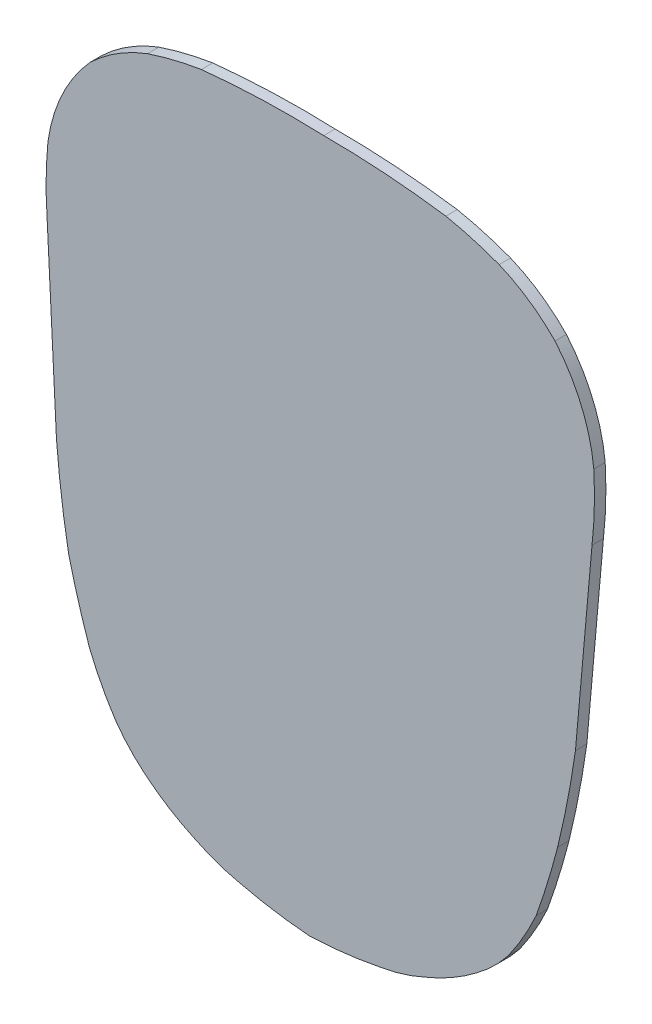
ISO-10303-21;
HEADER;
FILE_DESCRIPTION(('STEP AP214'),'2;1');
FILE_NAME('part.step','',(''),(''),'','','');
FILE_SCHEMA(('AUTOMOTIVE_DESIGN { 1 0 10303 214 1 1 1 1 }'));
ENDSEC;
DATA;
#1=APPLICATION_CONTEXT('core data for automotive mechanical design processes');
#2=APPLICATION_PROTOCOL_DEFINITION('international standard','automotive_design',2000,#1);
#3=PRODUCT_CONTEXT('',#1,'mechanical');
#4=PRODUCT('Part','Part','',(#3));
#5=PRODUCT_RELATED_PRODUCT_CATEGORY('part','',(#4));
#6=PRODUCT_DEFINITION_FORMATION('','',#4);
#7=PRODUCT_DEFINITION_CONTEXT('part definition',#1,'design');
#8=PRODUCT_DEFINITION('design','',#6,#7);
#9=PRODUCT_DEFINITION_SHAPE('','',#8);
#10=(LENGTH_UNIT() NAMED_UNIT(*) SI_UNIT(.MILLI.,.METRE.));
#11=(NAMED_UNIT(*) PLANE_ANGLE_UNIT() SI_UNIT($,.RADIAN.));
#12=(NAMED_UNIT(*) SI_UNIT($,.STERADIAN.) SOLID_ANGLE_UNIT());
#13=UNCERTAINTY_MEASURE_WITH_UNIT(LENGTH_MEASURE(1.E-05),#10,'distance_accuracy_value','');
#14=(GEOMETRIC_REPRESENTATION_CONTEXT(3) GLOBAL_UNCERTAINTY_ASSIGNED_CONTEXT((#13)) GLOBAL_UNIT_ASSIGNED_CONTEXT((#10,
#11,#12)) REPRESENTATION_CONTEXT('',''));
#15=CARTESIAN_POINT('',(0.,0.,0.));
#16=DIRECTION('',(0.,0.,1.));
#17=DIRECTION('',(1.,0.,0.));
#18=AXIS2_PLACEMENT_3D('',#15,#16,#17);
#19=CARTESIAN_POINT('',(-2.87645068487016,-22.2307778413905,37.7490965279302));
#20=DIRECTION('',(0.,0.,1.));
#21=DIRECTION('',(0.0193548335692301,0.999812677663925,0.));
#22=AXIS2_PLACEMENT_3D('',#19,#20,#21);
#23=PLANE('',#22);
#24=CARTESIAN_POINT('',(3.40605421210544,8.02001484887181,37.74909652793));
#25=DIRECTION('',(0.,0.,-1.));
#26=DIRECTION('',(-0.0193548335692301,-0.999812677663925,0.));
#27=AXIS2_PLACEMENT_3D('',#24,#25,#26);
#28=CIRCLE('',#27,7.43643173112);
#29=CARTESIAN_POINT('',(8.74976189327244,13.1916011731871,37.74909652793));
#30=VERTEX_POINT('',#29);
#31=CARTESIAN_POINT('',(6.29473617833669,14.8724621043842,37.74909652793));
#32=VERTEX_POINT('',#31);
#33=EDGE_CURVE('E400',#30,#32,#28,.F.);
#34=ORIENTED_EDGE('',*,*,#33,.F.);
#35=CARTESIAN_POINT('',(3.11803650286193,8.43130453548566,37.7490965279299));
#36=DIRECTION('',(0.,0.,-1.));
#37=DIRECTION('',(-0.0193548335692301,-0.999812677663925,0.));
#38=AXIS2_PLACEMENT_3D('',#35,#36,#37);
#39=CIRCLE('',#38,7.3740595978);
#40=CARTESIAN_POINT('',(10.4553019723894,9.16702892789532,37.7490965279302));
#41=VERTEX_POINT('',#40);
#42=EDGE_CURVE('E194',#41,#30,#39,.F.);
#43=ORIENTED_EDGE('',*,*,#42,.F.);
#44=CARTESIAN_POINT('',(-6.32552371849095,8.14421174061835,37.7490965279296));
#45=DIRECTION('',(0.,0.,-1.));
#46=DIRECTION('',(-0.0193548335692301,-0.999812677663925,0.));
#47=AXIS2_PLACEMENT_3D('',#44,#45,#46);
#48=CIRCLE('',#47,16.81196793556);
#49=CARTESIAN_POINT('',(10.3766044314373,6.2255713027891,37.7490965279302));
#50=VERTEX_POINT('',#49);
#51=EDGE_CURVE('E20',#50,#41,#48,.F.);
#52=ORIENTED_EDGE('',*,*,#51,.F.);
#53=DIRECTION('',(-0.0886995040357044,-0.996058431008854,0.));
#54=VECTOR('',#53,1.);
#55=CARTESIAN_POINT('',(10.3766044314373,6.22557130278913,37.7490965279302));
#56=LINE('',#55,#54);
#57=CARTESIAN_POINT('',(9.64811099468481,-1.95510611475094,37.7490965279302));
#58=VERTEX_POINT('',#57);
#59=EDGE_CURVE('E193',#50,#58,#56,.T.);
#60=ORIENTED_EDGE('',*,*,#59,.T.);
#61=CARTESIAN_POINT('',(-31.2814474166911,3.80134354731966,37.7490965279289));
#62=DIRECTION('',(0.,0.,-1.));
#63=DIRECTION('',(-0.0193548335692301,-0.999812677663925,0.));
#64=AXIS2_PLACEMENT_3D('',#61,#62,#63);
#65=CIRCLE('',#64,41.33237791928);
#66=CARTESIAN_POINT('',(8.86403234955447,-6.03257321052169,37.7490965279303));
#67=VERTEX_POINT('',#66);
#68=EDGE_CURVE('E206',#67,#58,#65,.F.);
#69=ORIENTED_EDGE('',*,*,#68,.F.);
#70=CARTESIAN_POINT('',(-24.973760623793,2.68335405814088,37.7490965279291));
#71=DIRECTION('',(0.,0.,-1.));
#72=DIRECTION('',(-0.0193548335692301,-0.999812677663925,0.));
#73=AXIS2_PLACEMENT_3D('',#70,#71,#72);
#74=CIRCLE('',#73,34.94228987144);
#75=CARTESIAN_POINT('',(7.91947678147986,-9.10641075970419,37.7490965279303));
#76=VERTEX_POINT('',#75);
#77=EDGE_CURVE('E320',#76,#67,#74,.F.);
#78=ORIENTED_EDGE('',*,*,#77,.F.);
#79=CARTESIAN_POINT('',(-3.58067037627299,-3.93497982202906,37.7490965279299));
#80=DIRECTION('',(0.,0.,-1.));
#81=DIRECTION('',(-0.0193548335692301,-0.999812677663925,0.));
#82=AXIS2_PLACEMENT_3D('',#79,#80,#81);
#83=CIRCLE('',#82,12.60940452968);
#84=CARTESIAN_POINT('',(6.6977668305515,-11.2391437836663,37.7490965279303));
#85=VERTEX_POINT('',#84);
#86=EDGE_CURVE('E324',#85,#76,#83,.F.);
#87=ORIENTED_EDGE('',*,*,#86,.F.);
#88=CARTESIAN_POINT('',(1.10266886694143,-6.8693447401081,37.74909652793));
#89=DIRECTION('',(0.,0.,-1.));
#90=DIRECTION('',(-0.0193548335692301,-0.999812677663925,0.));
#91=AXIS2_PLACEMENT_3D('',#88,#89,#90);
#92=CIRCLE('',#91,7.09931439672);
#93=CARTESIAN_POINT('',(5.30083998115867,-12.5943446701717,37.7490965279303));
#94=VERTEX_POINT('',#93);
#95=EDGE_CURVE('E328',#94,#85,#92,.F.);
#96=ORIENTED_EDGE('',*,*,#95,.F.);
#97=CARTESIAN_POINT('',(-0.638723059391806,-4.8395373063229,37.74909652793));
#98=DIRECTION('',(0.,0.,-1.));
#99=DIRECTION('',(-0.0193548335692301,-0.999812677663925,0.));
#100=AXIS2_PLACEMENT_3D('',#97,#98,#99);
#101=CIRCLE('',#100,9.76808304444);
#102=CARTESIAN_POINT('',(3.02325465351682,-13.8952187049387,37.7490965279302));
#103=VERTEX_POINT('',#102);
#104=EDGE_CURVE('E332',#103,#94,#101,.F.);
#105=ORIENTED_EDGE('',*,*,#104,.F.);
#106=CARTESIAN_POINT('',(-0.207770559998101,-6.83732878190939,37.74909652793));
#107=DIRECTION('',(0.,0.,-1.));
#108=DIRECTION('',(-0.0193548335692301,-0.999812677663925,0.));
#109=AXIS2_PLACEMENT_3D('',#106,#107,#108);
#110=CIRCLE('',#109,7.76230211316);
#111=CARTESIAN_POINT('',(1.1176538211111,-14.4856347581325,37.7490965279302));
#112=VERTEX_POINT('',#111);
#113=EDGE_CURVE('E336',#112,#103,#110,.F.);
#114=ORIENTED_EDGE('',*,*,#113,.F.);
#115=CARTESIAN_POINT('',(-2.80966912930586,4.75500909683406,37.7490965279298));
#116=DIRECTION('',(0.,0.,-1.));
#117=DIRECTION('',(-0.0193548335692301,-0.999812677663925,0.));
#118=AXIS2_PLACEMENT_3D('',#115,#116,#117);
#119=CIRCLE('',#118,19.6373684976);
#120=CARTESIAN_POINT('',(-2.01526832310904,-14.8662846645275,37.7490965279301));
#121=VERTEX_POINT('',#120);
#122=EDGE_CURVE('E340',#121,#112,#119,.F.);
#123=ORIENTED_EDGE('',*,*,#122,.F.);
#124=CARTESIAN_POINT('',(-0.523207579480535,4.71400533480674,37.7490965279299));
#125=DIRECTION('',(0.,0.,-1.));
#126=DIRECTION('',(-0.0193548335692301,-0.999812677663925,0.));
#127=AXIS2_PLACEMENT_3D('',#124,#125,#126);
#128=CIRCLE('',#127,19.63705684976);
#129=CARTESIAN_POINT('',(-5.17633782189552,-14.3637927736708,37.74909652793));
#130=VERTEX_POINT('',#129);
#131=EDGE_CURVE('E344',#130,#121,#128,.F.);
#132=ORIENTED_EDGE('',*,*,#131,.F.);
#133=CARTESIAN_POINT('',(-3.55589855490548,-6.77251418057695,37.7490965279299));
#134=DIRECTION('',(0.,0.,-1.));
#135=DIRECTION('',(-0.0193548335692301,-0.999812677663925,0.));
#136=AXIS2_PLACEMENT_3D('',#133,#134,#135);
#137=CIRCLE('',#136,7.76230211316);
#138=CARTESIAN_POINT('',(-7.05766041396077,-13.7000677154429,37.7490965279299));
#139=VERTEX_POINT('',#138);
#140=EDGE_CURVE('E348',#139,#130,#137,.F.);
#141=ORIENTED_EDGE('',*,*,#140,.F.);
#142=CARTESIAN_POINT('',(-3.04794957670766,-4.7928983915392,37.7490965279299));
#143=DIRECTION('',(0.,0.,-1.));
#144=DIRECTION('',(-0.0193548335692301,-0.999812677663925,0.));
#145=AXIS2_PLACEMENT_3D('',#142,#143,#144);
#146=CIRCLE('',#145,9.76808304444);
#147=CARTESIAN_POINT('',(-9.28319236302824,-12.3120202657153,37.7490965279298));
#148=VERTEX_POINT('',#147);
#149=EDGE_CURVE('E352',#148,#139,#146,.F.);
#150=ORIENTED_EDGE('',*,*,#149,.F.);
#151=CARTESIAN_POINT('',(-4.76167465689586,-6.83879977530864,37.7490965279299));
#152=DIRECTION('',(0.,0.,-1.));
#153=DIRECTION('',(-0.0193548335692301,-0.999812677663925,0.));
#154=AXIS2_PLACEMENT_3D('',#151,#152,#153);
#155=CIRCLE('',#154,7.09931439672);
#156=CARTESIAN_POINT('',(-10.5813963887554,-10.9046457963968,37.7490965279298));
#157=VERTEX_POINT('',#156);
#158=EDGE_CURVE('E356',#157,#148,#155,.F.);
#159=ORIENTED_EDGE('',*,*,#158,.F.);
#160=CARTESIAN_POINT('',(-0.0279711922388365,-4.00375460651088,37.74909652793));
#161=DIRECTION('',(0.,0.,-1.));
#162=DIRECTION('',(-0.0193548335692301,-0.999812677663925,0.));
#163=AXIS2_PLACEMENT_3D('',#160,#161,#162);
#164=CIRCLE('',#163,12.60940452968);
#165=CARTESIAN_POINT('',(-11.7196490905639,-8.72622753019508,37.7490965279297));
#166=VERTEX_POINT('',#165);
#167=EDGE_CURVE('E360',#166,#157,#164,.F.);
#168=ORIENTED_EDGE('',*,*,#167,.F.);
#169=CARTESIAN_POINT('',(21.3074102324667,2.68328490166428,37.7490965279306));
#170=DIRECTION('',(0.,0.,-1.));
#171=DIRECTION('',(-0.0193548335692301,-0.999812677663925,0.));
#172=AXIS2_PLACEMENT_3D('',#169,#170,#171);
#173=CIRCLE('',#172,34.94228987144);
#174=CARTESIAN_POINT('',(-12.6348799299236,-5.61638738053116,37.7490965279296));
#175=VERTEX_POINT('',#174);
#176=EDGE_CURVE('E364',#175,#166,#173,.F.);
#177=ORIENTED_EDGE('',*,*,#176,.F.);
#178=CARTESIAN_POINT('',(28.0310735031444,1.77588533100571,37.7490965279308));
#179=DIRECTION('',(0.,0.,-1.));
#180=DIRECTION('',(-0.0193548335692301,-0.999812677663925,0.));
#181=AXIS2_PLACEMENT_3D('',#178,#179,#180);
#182=CIRCLE('',#181,41.33237791928);
#183=CARTESIAN_POINT('',(-13.1702154109103,-1.51337845938621,37.7490965279296));
#184=VERTEX_POINT('',#183);
#185=EDGE_CURVE('E368',#184,#175,#182,.F.);
#186=ORIENTED_EDGE('',*,*,#185,.F.);
#187=DIRECTION('',(-0.0500831809567765,0.998745050042928,0.));
#188=VECTOR('',#187,1.);
#189=CARTESIAN_POINT('',(-13.1702154109103,-1.51337845938582,37.7490965279296));
#190=LINE('',#189,#188);
#191=CARTESIAN_POINT('',(-13.5815510662259,6.68936429385876,37.7490965279294));
#192=VERTEX_POINT('',#191);
#193=EDGE_CURVE('E219',#184,#192,#190,.T.);
#194=ORIENTED_EDGE('',*,*,#193,.T.);
#195=CARTESIAN_POINT('',(3.18231954948581,7.96015453853926,37.74909652793));
#196=DIRECTION('',(0.,0.,-1.));
#197=DIRECTION('',(-0.0193548335692301,-0.999812677663925,0.));
#198=AXIS2_PLACEMENT_3D('',#195,#196,#197);
#199=CIRCLE('',#198,16.81196793556);
#200=CARTESIAN_POINT('',(-13.5463481289565,9.63166390750369,37.7490965279294));
#201=VERTEX_POINT('',#200);
#202=EDGE_CURVE('E223',#201,#192,#199,.F.);
#203=ORIENTED_EDGE('',*,*,#202,.F.);
#204=CARTESIAN_POINT('',(-6.24305419079941,8.61252083374827,37.7490965279296));
#205=DIRECTION('',(0.,0.,-1.));
#206=DIRECTION('',(-0.0193548335692301,-0.999812677663925,0.));
#207=AXIS2_PLACEMENT_3D('',#204,#205,#206);
#208=CIRCLE('',#207,7.3740595978);
#209=CARTESIAN_POINT('',(-11.6863252040826,13.5872123445715,37.7490965279294));
#210=VERTEX_POINT('',#209);
#211=EDGE_CURVE('E376',#210,#201,#208,.F.);
#212=ORIENTED_EDGE('',*,*,#211,.F.);
#213=CARTESIAN_POINT('',(-6.54677401618388,8.21268627443502,37.7490965279296));
#214=DIRECTION('',(0.,0.,-1.));
#215=DIRECTION('',(-0.0193548335692301,-0.999812677663925,0.));
#216=AXIS2_PLACEMENT_3D('',#213,#214,#215);
#217=CIRCLE('',#216,7.43643173112);
#218=CARTESIAN_POINT('',(-9.16808546254458,15.17179851615,37.7490965279295));
#219=VERTEX_POINT('',#218);
#220=EDGE_CURVE('E380',#219,#210,#217,.F.);
#221=ORIENTED_EDGE('',*,*,#220,.F.);
#222=CARTESIAN_POINT('',(-4.43670572158507,1.02428534892829,37.7490965279298));
#223=DIRECTION('',(0.,0.,-1.));
#224=DIRECTION('',(-0.0193548335692301,-0.999812677663925,0.));
#225=AXIS2_PLACEMENT_3D('',#222,#223,#224);
#226=CIRCLE('',#225,14.91771038296);
#227=CARTESIAN_POINT('',(-6.80003650135269,15.7536013783736,37.7490965279295));
#228=VERTEX_POINT('',#227);
#229=EDGE_CURVE('E384',#228,#219,#226,.F.);
#230=ORIENTED_EDGE('',*,*,#229,.F.);
#231=CARTESIAN_POINT('',(-2.87645068487016,-22.2307778413905,37.7490965279302));
#232=DIRECTION('',(0.,0.,-1.));
#233=DIRECTION('',(-0.0193548335692301,-0.999812677663925,0.));
#234=AXIS2_PLACEMENT_3D('',#231,#232,#233);
#235=CIRCLE('',#234,38.18648439396);
#236=CARTESIAN_POINT('',(-1.41914055333809,15.9278887698878,37.7490965279297));
#237=VERTEX_POINT('',#236);
#238=EDGE_CURVE('E388',#237,#228,#235,.F.);
#239=ORIENTED_EDGE('',*,*,#238,.F.);
#240=CARTESIAN_POINT('',(-1.43975485684205,-22.2585901013477,37.7490965279302));
#241=DIRECTION('',(0.,0.,-1.));
#242=DIRECTION('',(-0.0193548335692301,-0.999812677663925,0.));
#243=AXIS2_PLACEMENT_3D('',#240,#241,#242);
#244=CIRCLE('',#243,38.186484435371);
#245=CARTESIAN_POINT('',(3.95097858118662,15.5454782846467,37.7490965279299));
#246=VERTEX_POINT('',#245);
#247=EDGE_CURVE('E392',#246,#237,#244,.F.);
#248=ORIENTED_EDGE('',*,*,#247,.F.);
#249=CARTESIAN_POINT('',(1.01935833845516,0.918664351931265,37.74909652793));
#250=DIRECTION('',(0.,0.,-1.));
#251=DIRECTION('',(-0.0193548335692301,-0.999812677663925,0.));
#252=AXIS2_PLACEMENT_3D('',#249,#250,#251);
#253=CIRCLE('',#252,14.91771038296);
#254=EDGE_CURVE('E396',#32,#246,#253,.F.);
#255=ORIENTED_EDGE('',*,*,#254,.F.);
#256=EDGE_LOOP('',(#34,#43,#52,#60,#69,#78,#87,#96,#105,#114,#123,#132,#141,#150,#159,#168,#177,
#186,#194,#203,#212,#221,#230,#239,#248,#255));
#257=FACE_BOUND('',#256,.T.);
#258=ADVANCED_FACE('F17',(#257),#23,.F.);
#259=CARTESIAN_POINT('',(-6.32552371849096,8.14421174061835,38.1300965279296));
#260=DIRECTION('',(0.,0.,-1.));
#261=DIRECTION('',(-0.0193548335692301,-0.999812677663925,0.));
#262=AXIS2_PLACEMENT_3D('',#259,#260,#261);
#263=CYLINDRICAL_SURFACE('',#262,16.81196793556);
#264=DIRECTION('',(0.,0.,-1.));
#265=VECTOR('',#264,1.);
#266=CARTESIAN_POINT('',(10.4553019723893,9.16702892789537,38.1300965279302));
#267=LINE('',#266,#265);
#268=CARTESIAN_POINT('',(10.4553019723893,9.16702892789536,38.2500965279301));
#269=VERTEX_POINT('',#268);
#270=EDGE_CURVE('E198',#269,#41,#267,.T.);
#271=ORIENTED_EDGE('',*,*,#270,.F.);
#272=CARTESIAN_POINT('',(-6.32552371849096,8.14421174061835,38.2500965279296));
#273=DIRECTION('',(0.,0.,-1.));
#274=DIRECTION('',(-0.0193548335692301,-0.999812677663925,0.));
#275=AXIS2_PLACEMENT_3D('',#272,#273,#274);
#276=CIRCLE('',#275,16.81196793556);
#277=CARTESIAN_POINT('',(10.3766044314372,6.22557130278923,38.2500965279302));
#278=VERTEX_POINT('',#277);
#279=EDGE_CURVE('E203',#278,#269,#276,.F.);
#280=ORIENTED_EDGE('',*,*,#279,.F.);
#281=DIRECTION('',(0.,0.,1.));
#282=VECTOR('',#281,1.);
#283=CARTESIAN_POINT('',(10.3766044314372,6.22557130278915,38.1300965279302));
#284=LINE('',#283,#282);
#285=EDGE_CURVE('E200',#278,#50,#284,.F.);
#286=ORIENTED_EDGE('',*,*,#285,.T.);
#287=ORIENTED_EDGE('',*,*,#51,.T.);
#288=EDGE_LOOP('',(#271,#280,#286,#287));
#289=FACE_BOUND('',#288,.T.);
#290=ADVANCED_FACE('F201',(#289),#263,.T.);
#291=CARTESIAN_POINT('',(3.11803650286192,8.43130453548566,38.1300965279299));
#292=DIRECTION('',(0.,0.,-1.));
#293=DIRECTION('',(-0.0193548335692301,-0.999812677663925,0.));
#294=AXIS2_PLACEMENT_3D('',#291,#292,#293);
#295=CYLINDRICAL_SURFACE('',#294,7.3740595978);
#296=DIRECTION('',(0.,0.,-1.));
#297=VECTOR('',#296,1.);
#298=CARTESIAN_POINT('',(8.74976189327242,13.1916011731871,38.13009652793));
#299=LINE('',#298,#297);
#300=CARTESIAN_POINT('',(8.74976189327242,13.1916011731871,38.25009652793));
#301=VERTEX_POINT('',#300);
#302=EDGE_CURVE('E402',#301,#30,#299,.T.);
#303=ORIENTED_EDGE('',*,*,#302,.F.);
#304=CARTESIAN_POINT('',(3.11803650286191,8.43130453548566,38.2500965279299));
#305=DIRECTION('',(0.,0.,-1.));
#306=DIRECTION('',(-0.0193548335692301,-0.999812677663925,0.));
#307=AXIS2_PLACEMENT_3D('',#304,#305,#306);
#308=CIRCLE('',#307,7.3740595978);
#309=EDGE_CURVE('E312',#269,#301,#308,.F.);
#310=ORIENTED_EDGE('',*,*,#309,.F.);
#311=ORIENTED_EDGE('',*,*,#270,.T.);
#312=ORIENTED_EDGE('',*,*,#42,.T.);
#313=EDGE_LOOP('',(#303,#310,#311,#312));
#314=FACE_BOUND('',#313,.T.);
#315=ADVANCED_FACE('F411',(#314),#295,.T.);
#316=CARTESIAN_POINT('',(3.40605421210543,8.02001484887182,38.13009652793));
#317=DIRECTION('',(0.,0.,-1.));
#318=DIRECTION('',(-0.0193548335692301,-0.999812677663925,0.));
#319=AXIS2_PLACEMENT_3D('',#316,#317,#318);
#320=CYLINDRICAL_SURFACE('',#319,7.43643173112);
#321=DIRECTION('',(0.,0.,-1.));
#322=VECTOR('',#321,1.);
#323=CARTESIAN_POINT('',(6.29473617833669,14.8724621043842,38.13009652793));
#324=LINE('',#323,#322);
#325=CARTESIAN_POINT('',(6.29473617833668,14.8724621043842,38.2500965279299));
#326=VERTEX_POINT('',#325);
#327=EDGE_CURVE('E399',#326,#32,#324,.T.);
#328=ORIENTED_EDGE('',*,*,#327,.F.);
#329=CARTESIAN_POINT('',(3.40605421210542,8.02001484887182,38.2500965279299));
#330=DIRECTION('',(0.,0.,-1.));
#331=DIRECTION('',(-0.0193548335692301,-0.999812677663925,0.));
#332=AXIS2_PLACEMENT_3D('',#329,#330,#331);
#333=CIRCLE('',#332,7.43643173112);
#334=EDGE_CURVE('E308',#301,#326,#333,.F.);
#335=ORIENTED_EDGE('',*,*,#334,.F.);
#336=ORIENTED_EDGE('',*,*,#302,.T.);
#337=ORIENTED_EDGE('',*,*,#33,.T.);
#338=EDGE_LOOP('',(#328,#335,#336,#337));
#339=FACE_BOUND('',#338,.T.);
#340=ADVANCED_FACE('F486',(#339),#320,.T.);
#341=CARTESIAN_POINT('',(1.01935833845515,0.918664351931272,38.13009652793));
#342=DIRECTION('',(0.,0.,-1.));
#343=DIRECTION('',(-0.0193548335692301,-0.999812677663925,0.));
#344=AXIS2_PLACEMENT_3D('',#341,#342,#343);
#345=CYLINDRICAL_SURFACE('',#344,14.91771038296);
#346=DIRECTION('',(0.,0.,-1.));
#347=VECTOR('',#346,1.);
#348=CARTESIAN_POINT('',(3.95097858118664,15.5454782846467,38.1300965279299));
#349=LINE('',#348,#347);
#350=CARTESIAN_POINT('',(3.95097858118661,15.5454782846467,38.2500965279298));
#351=VERTEX_POINT('',#350);
#352=EDGE_CURVE('E395',#351,#246,#349,.T.);
#353=ORIENTED_EDGE('',*,*,#352,.F.);
#354=CARTESIAN_POINT('',(1.01935833845515,0.918664351931274,38.2500965279299));
#355=DIRECTION('',(0.,0.,-1.));
#356=DIRECTION('',(-0.0193548335692301,-0.999812677663925,0.));
#357=AXIS2_PLACEMENT_3D('',#354,#355,#356);
#358=CIRCLE('',#357,14.91771038296);
#359=EDGE_CURVE('E304',#326,#351,#358,.F.);
#360=ORIENTED_EDGE('',*,*,#359,.F.);
#361=ORIENTED_EDGE('',*,*,#327,.T.);
#362=ORIENTED_EDGE('',*,*,#254,.T.);
#363=EDGE_LOOP('',(#353,#360,#361,#362));
#364=FACE_BOUND('',#363,.T.);
#365=ADVANCED_FACE('F482',(#364),#345,.T.);
#366=CARTESIAN_POINT('',(-1.43975485684206,-22.2585901013477,38.1300965279302));
#367=DIRECTION('',(0.,0.,-1.));
#368=DIRECTION('',(-0.0193548335692301,-0.999812677663925,0.));
#369=AXIS2_PLACEMENT_3D('',#366,#367,#368);
#370=CYLINDRICAL_SURFACE('',#369,38.186484435371);
#371=DIRECTION('',(0.,0.,-1.));
#372=VECTOR('',#371,1.);
#373=CARTESIAN_POINT('',(-1.41914055333799,15.9278887698878,38.1300965279297));
#374=LINE('',#373,#372);
#375=CARTESIAN_POINT('',(-1.4191405533381,15.9278887698878,38.2500965279296));
#376=VERTEX_POINT('',#375);
#377=EDGE_CURVE('E391',#376,#237,#374,.T.);
#378=ORIENTED_EDGE('',*,*,#377,.F.);
#379=CARTESIAN_POINT('',(-1.43975485684206,-22.2585901013477,38.2500965279302));
#380=DIRECTION('',(0.,0.,-1.));
#381=DIRECTION('',(-0.0193548335692301,-0.999812677663925,0.));
#382=AXIS2_PLACEMENT_3D('',#379,#380,#381);
#383=CIRCLE('',#382,38.186484435371);
#384=EDGE_CURVE('E300',#351,#376,#383,.F.);
#385=ORIENTED_EDGE('',*,*,#384,.F.);
#386=ORIENTED_EDGE('',*,*,#352,.T.);
#387=ORIENTED_EDGE('',*,*,#247,.T.);
#388=EDGE_LOOP('',(#378,#385,#386,#387));
#389=FACE_BOUND('',#388,.T.);
#390=ADVANCED_FACE('F491',(#389),#370,.T.);
#391=CARTESIAN_POINT('',(-2.87645068487017,-22.2307778413905,38.1300965279302));
#392=DIRECTION('',(0.,0.,-1.));
#393=DIRECTION('',(-0.0193548335692301,-0.999812677663925,0.));
#394=AXIS2_PLACEMENT_3D('',#391,#392,#393);
#395=CYLINDRICAL_SURFACE('',#394,38.18648439396);
#396=DIRECTION('',(0.,0.,-1.));
#397=VECTOR('',#396,1.);
#398=CARTESIAN_POINT('',(-6.80003650135271,15.7536013783736,38.1300965279295));
#399=LINE('',#398,#397);
#400=CARTESIAN_POINT('',(-6.80003650135273,15.7536013783736,38.2500965279295));
#401=VERTEX_POINT('',#400);
#402=EDGE_CURVE('E387',#401,#228,#399,.T.);
#403=ORIENTED_EDGE('',*,*,#402,.F.);
#404=CARTESIAN_POINT('',(-2.87645068487018,-22.2307778413905,38.2500965279301));
#405=DIRECTION('',(0.,0.,-1.));
#406=DIRECTION('',(-0.0193548335692301,-0.999812677663925,0.));
#407=AXIS2_PLACEMENT_3D('',#404,#405,#406);
#408=CIRCLE('',#407,38.18648439396);
#409=EDGE_CURVE('E296',#376,#401,#408,.F.);
#410=ORIENTED_EDGE('',*,*,#409,.F.);
#411=ORIENTED_EDGE('',*,*,#377,.T.);
#412=ORIENTED_EDGE('',*,*,#238,.T.);
#413=EDGE_LOOP('',(#403,#410,#411,#412));
#414=FACE_BOUND('',#413,.T.);
#415=ADVANCED_FACE('F495',(#414),#395,.T.);
#416=CARTESIAN_POINT('',(-4.43670572158509,1.0242853489283,38.1300965279298));
#417=DIRECTION('',(0.,0.,-1.));
#418=DIRECTION('',(-0.0193548335692301,-0.999812677663925,0.));
#419=AXIS2_PLACEMENT_3D('',#416,#417,#418);
#420=CYLINDRICAL_SURFACE('',#419,14.91771038296);
#421=DIRECTION('',(0.,0.,-1.));
#422=VECTOR('',#421,1.);
#423=CARTESIAN_POINT('',(-9.16808546254456,15.17179851615,38.1300965279295));
#424=LINE('',#423,#422);
#425=CARTESIAN_POINT('',(-9.16808546254458,15.17179851615,38.2500965279295));
#426=VERTEX_POINT('',#425);
#427=EDGE_CURVE('E383',#426,#219,#424,.T.);
#428=ORIENTED_EDGE('',*,*,#427,.F.);
#429=CARTESIAN_POINT('',(-4.43670572158509,1.0242853489283,38.2500965279298));
#430=DIRECTION('',(0.,0.,-1.));
#431=DIRECTION('',(-0.0193548335692301,-0.999812677663925,0.));
#432=AXIS2_PLACEMENT_3D('',#429,#430,#431);
#433=CIRCLE('',#432,14.91771038296);
#434=EDGE_CURVE('E292',#401,#426,#433,.F.);
#435=ORIENTED_EDGE('',*,*,#434,.F.);
#436=ORIENTED_EDGE('',*,*,#402,.T.);
#437=ORIENTED_EDGE('',*,*,#229,.T.);
#438=EDGE_LOOP('',(#428,#435,#436,#437));
#439=FACE_BOUND('',#438,.T.);
#440=ADVANCED_FACE('F497',(#439),#420,.T.);
#441=CARTESIAN_POINT('',(-6.5467740161839,8.21268627443503,38.1300965279296));
#442=DIRECTION('',(0.,0.,-1.));
#443=DIRECTION('',(-0.0193548335692301,-0.999812677663925,0.));
#444=AXIS2_PLACEMENT_3D('',#441,#442,#443);
#445=CYLINDRICAL_SURFACE('',#444,7.43643173112);
#446=DIRECTION('',(0.,0.,-1.));
#447=VECTOR('',#446,1.);
#448=CARTESIAN_POINT('',(-11.6863252040826,13.5872123445715,38.1300965279294));
#449=LINE('',#448,#447);
#450=CARTESIAN_POINT('',(-11.6863252040826,13.5872123445715,38.2500965279294));
#451=VERTEX_POINT('',#450);
#452=EDGE_CURVE('E379',#451,#210,#449,.T.);
#453=ORIENTED_EDGE('',*,*,#452,.F.);
#454=CARTESIAN_POINT('',(-6.5467740161839,8.21268627443503,38.2500965279296));
#455=DIRECTION('',(0.,0.,-1.));
#456=DIRECTION('',(-0.0193548335692301,-0.999812677663925,0.));
#457=AXIS2_PLACEMENT_3D('',#454,#455,#456);
#458=CIRCLE('',#457,7.43643173112);
#459=EDGE_CURVE('E288',#426,#451,#458,.F.);
#460=ORIENTED_EDGE('',*,*,#459,.F.);
#461=ORIENTED_EDGE('',*,*,#427,.T.);
#462=ORIENTED_EDGE('',*,*,#220,.T.);
#463=EDGE_LOOP('',(#453,#460,#461,#462));
#464=FACE_BOUND('',#463,.T.);
#465=ADVANCED_FACE('F501',(#464),#445,.T.);
#466=CARTESIAN_POINT('',(-6.24305419079942,8.61252083374827,38.1300965279296));
#467=DIRECTION('',(0.,0.,-1.));
#468=DIRECTION('',(-0.0193548335692301,-0.999812677663925,0.));
#469=AXIS2_PLACEMENT_3D('',#466,#467,#468);
#470=CYLINDRICAL_SURFACE('',#469,7.3740595978);
#471=DIRECTION('',(0.,0.,-1.));
#472=VECTOR('',#471,1.);
#473=CARTESIAN_POINT('',(-13.5463481289565,9.6316639075037,38.1300965279294));
#474=LINE('',#473,#472);
#475=CARTESIAN_POINT('',(-13.5463481289566,9.63166390750369,38.2500965279294));
#476=VERTEX_POINT('',#475);
#477=EDGE_CURVE('E375',#476,#201,#474,.T.);
#478=ORIENTED_EDGE('',*,*,#477,.F.);
#479=CARTESIAN_POINT('',(-6.24305419079943,8.61252083374827,38.2500965279296));
#480=DIRECTION('',(0.,0.,-1.));
#481=DIRECTION('',(-0.0193548335692301,-0.999812677663925,0.));
#482=AXIS2_PLACEMENT_3D('',#479,#480,#481);
#483=CIRCLE('',#482,7.3740595978);
#484=EDGE_CURVE('E284',#451,#476,#483,.F.);
#485=ORIENTED_EDGE('',*,*,#484,.F.);
#486=ORIENTED_EDGE('',*,*,#452,.T.);
#487=ORIENTED_EDGE('',*,*,#211,.T.);
#488=EDGE_LOOP('',(#478,#485,#486,#487));
#489=FACE_BOUND('',#488,.T.);
#490=ADVANCED_FACE('F506',(#489),#470,.T.);
#491=CARTESIAN_POINT('',(3.1823195494858,7.96015453853927,38.13009652793));
#492=DIRECTION('',(0.,0.,-1.));
#493=DIRECTION('',(-0.0193548335692301,-0.999812677663925,0.));
#494=AXIS2_PLACEMENT_3D('',#491,#492,#493);
#495=CYLINDRICAL_SURFACE('',#494,16.81196793556);
#496=DIRECTION('',(0.,0.,1.));
#497=VECTOR('',#496,1.);
#498=CARTESIAN_POINT('',(-13.5815510662259,6.68936429385879,38.1300965279294));
#499=LINE('',#498,#497);
#500=CARTESIAN_POINT('',(-13.5815510662259,6.68936429385877,38.2500965279294));
#501=VERTEX_POINT('',#500);
#502=EDGE_CURVE('E222',#192,#501,#499,.T.);
#503=ORIENTED_EDGE('',*,*,#502,.T.);
#504=CARTESIAN_POINT('',(3.1823195494858,7.96015453853927,38.2500965279299));
#505=DIRECTION('',(0.,0.,-1.));
#506=DIRECTION('',(-0.0193548335692301,-0.999812677663925,0.));
#507=AXIS2_PLACEMENT_3D('',#504,#505,#506);
#508=CIRCLE('',#507,16.81196793556);
#509=EDGE_CURVE('E280',#476,#501,#508,.F.);
#510=ORIENTED_EDGE('',*,*,#509,.F.);
#511=ORIENTED_EDGE('',*,*,#477,.T.);
#512=ORIENTED_EDGE('',*,*,#202,.T.);
#513=EDGE_LOOP('',(#503,#510,#511,#512));
#514=FACE_BOUND('',#513,.T.);
#515=ADVANCED_FACE('F510',(#514),#495,.T.);
#516=CARTESIAN_POINT('',(-13.1702154109103,-1.51337845938581,38.1300965279296));
#517=DIRECTION('',(0.998745050042928,0.0500831809567765,0.));
#518=DIRECTION('',(-0.0500831809567765,0.998745050042928,0.));
#519=AXIS2_PLACEMENT_3D('',#516,#517,#518);
#520=PLANE('',#519);
#521=ORIENTED_EDGE('',*,*,#502,.F.);
#522=ORIENTED_EDGE('',*,*,#193,.F.);
#523=DIRECTION('',(0.,0.,-1.));
#524=VECTOR('',#523,1.);
#525=CARTESIAN_POINT('',(-13.1702154109103,-1.51337845938602,38.1300965279296));
#526=LINE('',#525,#524);
#527=CARTESIAN_POINT('',(-13.1702154109103,-1.51337845938607,38.2500965279295));
#528=VERTEX_POINT('',#527);
#529=EDGE_CURVE('E371',#528,#184,#526,.T.);
#530=ORIENTED_EDGE('',*,*,#529,.F.);
#531=DIRECTION('',(0.050083180956776,-0.998745050042928,0.));
#532=VECTOR('',#531,1.);
#533=CARTESIAN_POINT('',(-13.5815510662259,6.68936429385873,38.2500965279294));
#534=LINE('',#533,#532);
#535=EDGE_CURVE('E279',#501,#528,#534,.T.);
#536=ORIENTED_EDGE('',*,*,#535,.F.);
#537=EDGE_LOOP('',(#521,#522,#530,#536));
#538=FACE_BOUND('',#537,.T.);
#539=ADVANCED_FACE('F514',(#538),#520,.F.);
#540=CARTESIAN_POINT('',(28.0310735031444,1.77588533100572,38.1300965279308));
#541=DIRECTION('',(0.,0.,-1.));
#542=DIRECTION('',(-0.0193548335692301,-0.999812677663925,0.));
#543=AXIS2_PLACEMENT_3D('',#540,#541,#542);
#544=CYLINDRICAL_SURFACE('',#543,41.33237791928);
#545=DIRECTION('',(0.,0.,-1.));
#546=VECTOR('',#545,1.);
#547=CARTESIAN_POINT('',(-12.6348799299236,-5.61638738053124,38.1300965279296));
#548=LINE('',#547,#546);
#549=CARTESIAN_POINT('',(-12.6348799299236,-5.61638738053115,38.2500965279296));
#550=VERTEX_POINT('',#549);
#551=EDGE_CURVE('E367',#550,#175,#548,.T.);
#552=ORIENTED_EDGE('',*,*,#551,.F.);
#553=CARTESIAN_POINT('',(28.0310735031444,1.77588533100572,38.2500965279308));
#554=DIRECTION('',(0.,0.,-1.));
#555=DIRECTION('',(-0.0193548335692301,-0.999812677663925,0.));
#556=AXIS2_PLACEMENT_3D('',#553,#554,#555);
#557=CIRCLE('',#556,41.33237791928);
#558=EDGE_CURVE('E275',#528,#550,#557,.F.);
#559=ORIENTED_EDGE('',*,*,#558,.F.);
#560=ORIENTED_EDGE('',*,*,#529,.T.);
#561=ORIENTED_EDGE('',*,*,#185,.T.);
#562=EDGE_LOOP('',(#552,#559,#560,#561));
#563=FACE_BOUND('',#562,.T.);
#564=ADVANCED_FACE('F522',(#563),#544,.T.);
#565=CARTESIAN_POINT('',(21.3074102324666,2.68328490166428,38.1300965279306));
#566=DIRECTION('',(0.,0.,-1.));
#567=DIRECTION('',(-0.0193548335692301,-0.999812677663925,0.));
#568=AXIS2_PLACEMENT_3D('',#565,#566,#567);
#569=CYLINDRICAL_SURFACE('',#568,34.94228987144);
#570=DIRECTION('',(0.,0.,-1.));
#571=VECTOR('',#570,1.);
#572=CARTESIAN_POINT('',(-11.719649090564,-8.72622753019503,38.1300965279297));
#573=LINE('',#572,#571);
#574=CARTESIAN_POINT('',(-11.719649090564,-8.72622753019504,38.2500965279297));
#575=VERTEX_POINT('',#574);
#576=EDGE_CURVE('E363',#575,#166,#573,.T.);
#577=ORIENTED_EDGE('',*,*,#576,.F.);
#578=CARTESIAN_POINT('',(21.3074102324666,2.68328490166428,38.2500965279306));
#579=DIRECTION('',(0.,0.,-1.));
#580=DIRECTION('',(-0.0193548335692301,-0.999812677663925,0.));
#581=AXIS2_PLACEMENT_3D('',#578,#579,#580);
#582=CIRCLE('',#581,34.94228987144);
#583=EDGE_CURVE('E271',#550,#575,#582,.F.);
#584=ORIENTED_EDGE('',*,*,#583,.F.);
#585=ORIENTED_EDGE('',*,*,#551,.T.);
#586=ORIENTED_EDGE('',*,*,#176,.T.);
#587=EDGE_LOOP('',(#577,#584,#585,#586));
#588=FACE_BOUND('',#587,.T.);
#589=ADVANCED_FACE('F526',(#588),#569,.T.);
#590=CARTESIAN_POINT('',(-0.0279711922388487,-4.00375460651087,38.13009652793));
#591=DIRECTION('',(0.,0.,-1.));
#592=DIRECTION('',(-0.0193548335692301,-0.999812677663925,0.));
#593=AXIS2_PLACEMENT_3D('',#590,#591,#592);
#594=CYLINDRICAL_SURFACE('',#593,12.60940452968);
#595=DIRECTION('',(0.,0.,-1.));
#596=VECTOR('',#595,1.);
#597=CARTESIAN_POINT('',(-10.5813963887554,-10.9046457963967,38.1300965279298));
#598=LINE('',#597,#596);
#599=CARTESIAN_POINT('',(-10.5813963887554,-10.9046457963968,38.2500965279297));
#600=VERTEX_POINT('',#599);
#601=EDGE_CURVE('E359',#600,#157,#598,.T.);
#602=ORIENTED_EDGE('',*,*,#601,.F.);
#603=CARTESIAN_POINT('',(-0.0279711922388526,-4.00375460651087,38.25009652793));
#604=DIRECTION('',(0.,0.,-1.));
#605=DIRECTION('',(-0.0193548335692301,-0.999812677663925,0.));
#606=AXIS2_PLACEMENT_3D('',#603,#604,#605);
#607=CIRCLE('',#606,12.60940452968);
#608=EDGE_CURVE('E267',#575,#600,#607,.F.);
#609=ORIENTED_EDGE('',*,*,#608,.F.);
#610=ORIENTED_EDGE('',*,*,#576,.T.);
#611=ORIENTED_EDGE('',*,*,#167,.T.);
#612=EDGE_LOOP('',(#602,#609,#610,#611));
#613=FACE_BOUND('',#612,.T.);
#614=ADVANCED_FACE('F530',(#613),#594,.T.);
#615=CARTESIAN_POINT('',(-4.76167465689587,-6.83879977530864,38.1300965279299));
#616=DIRECTION('',(0.,0.,-1.));
#617=DIRECTION('',(-0.0193548335692301,-0.999812677663925,0.));
#618=AXIS2_PLACEMENT_3D('',#615,#616,#617);
#619=CYLINDRICAL_SURFACE('',#618,7.09931439672);
#620=DIRECTION('',(0.,0.,-1.));
#621=VECTOR('',#620,1.);
#622=CARTESIAN_POINT('',(-9.28319236302893,-12.3120202657147,38.1300965279298));
#623=LINE('',#622,#621);
#624=CARTESIAN_POINT('',(-9.2831923630282,-12.3120202657153,38.2500965279298));
#625=VERTEX_POINT('',#624);
#626=EDGE_CURVE('E355',#625,#148,#623,.T.);
#627=ORIENTED_EDGE('',*,*,#626,.F.);
#628=CARTESIAN_POINT('',(-4.76167465689588,-6.83879977530864,38.2500965279299));
#629=DIRECTION('',(0.,0.,-1.));
#630=DIRECTION('',(-0.0193548335692301,-0.999812677663925,0.));
#631=AXIS2_PLACEMENT_3D('',#628,#629,#630);
#632=CIRCLE('',#631,7.09931439672);
#633=EDGE_CURVE('E263',#600,#625,#632,.F.);
#634=ORIENTED_EDGE('',*,*,#633,.F.);
#635=ORIENTED_EDGE('',*,*,#601,.T.);
#636=ORIENTED_EDGE('',*,*,#158,.T.);
#637=EDGE_LOOP('',(#627,#634,#635,#636));
#638=FACE_BOUND('',#637,.T.);
#639=ADVANCED_FACE('F534',(#638),#619,.T.);
#640=CARTESIAN_POINT('',(-3.04794957670768,-4.79289839153919,38.1300965279299));
#641=DIRECTION('',(0.,0.,-1.));
#642=DIRECTION('',(-0.0193548335692301,-0.999812677663925,0.));
#643=AXIS2_PLACEMENT_3D('',#640,#641,#642);
#644=CYLINDRICAL_SURFACE('',#643,9.76808304444);
#645=DIRECTION('',(0.,0.,-1.));
#646=VECTOR('',#645,1.);
#647=CARTESIAN_POINT('',(-7.05766041396078,-13.7000677154429,38.1300965279299));
#648=LINE('',#647,#646);
#649=CARTESIAN_POINT('',(-7.05766041396078,-13.7000677154429,38.2500965279299));
#650=VERTEX_POINT('',#649);
#651=EDGE_CURVE('E351',#650,#139,#648,.T.);
#652=ORIENTED_EDGE('',*,*,#651,.F.);
#653=CARTESIAN_POINT('',(-3.04794957670768,-4.79289839153919,38.2500965279299));
#654=DIRECTION('',(0.,0.,-1.));
#655=DIRECTION('',(-0.0193548335692301,-0.999812677663925,0.));
#656=AXIS2_PLACEMENT_3D('',#653,#654,#655);
#657=CIRCLE('',#656,9.76808304444);
#658=EDGE_CURVE('E259',#625,#650,#657,.F.);
#659=ORIENTED_EDGE('',*,*,#658,.F.);
#660=ORIENTED_EDGE('',*,*,#626,.T.);
#661=ORIENTED_EDGE('',*,*,#149,.T.);
#662=EDGE_LOOP('',(#652,#659,#660,#661));
#663=FACE_BOUND('',#662,.T.);
#664=ADVANCED_FACE('F538',(#663),#644,.T.);
#665=CARTESIAN_POINT('',(-3.55589855490549,-6.77251418057694,38.1300965279299));
#666=DIRECTION('',(0.,0.,-1.));
#667=DIRECTION('',(-0.0193548335692301,-0.999812677663925,0.));
#668=AXIS2_PLACEMENT_3D('',#665,#666,#667);
#669=CYLINDRICAL_SURFACE('',#668,7.76230211316);
#670=DIRECTION('',(0.,0.,-1.));
#671=VECTOR('',#670,1.);
#672=CARTESIAN_POINT('',(-5.1763378218955,-14.3637927736708,38.13009652793));
#673=LINE('',#672,#671);
#674=CARTESIAN_POINT('',(-5.17633782189547,-14.3637927736708,38.25009652793));
#675=VERTEX_POINT('',#674);
#676=EDGE_CURVE('E347',#675,#130,#673,.T.);
#677=ORIENTED_EDGE('',*,*,#676,.F.);
#678=CARTESIAN_POINT('',(-3.5558985549055,-6.77251418057694,38.2500965279299));
#679=DIRECTION('',(0.,0.,-1.));
#680=DIRECTION('',(-0.0193548335692301,-0.999812677663925,0.));
#681=AXIS2_PLACEMENT_3D('',#678,#679,#680);
#682=CIRCLE('',#681,7.76230211316);
#683=EDGE_CURVE('E255',#650,#675,#682,.F.);
#684=ORIENTED_EDGE('',*,*,#683,.F.);
#685=ORIENTED_EDGE('',*,*,#651,.T.);
#686=ORIENTED_EDGE('',*,*,#140,.T.);
#687=EDGE_LOOP('',(#677,#684,#685,#686));
#688=FACE_BOUND('',#687,.T.);
#689=ADVANCED_FACE('F542',(#688),#669,.T.);
#690=CARTESIAN_POINT('',(-0.523207579480548,4.71400533480674,38.1300965279299));
#691=DIRECTION('',(0.,0.,-1.));
#692=DIRECTION('',(-0.0193548335692301,-0.999812677663925,0.));
#693=AXIS2_PLACEMENT_3D('',#690,#691,#692);
#694=CYLINDRICAL_SURFACE('',#693,19.63705684976);
#695=DIRECTION('',(0.,0.,-1.));
#696=VECTOR('',#695,1.);
#697=CARTESIAN_POINT('',(-2.01526832310905,-14.8662846645275,38.1300965279301));
#698=LINE('',#697,#696);
#699=CARTESIAN_POINT('',(-2.01526832310905,-14.8662846645275,38.2500965279301));
#700=VERTEX_POINT('',#699);
#701=EDGE_CURVE('E343',#700,#121,#698,.T.);
#702=ORIENTED_EDGE('',*,*,#701,.F.);
#703=CARTESIAN_POINT('',(-0.523207579480551,4.71400533480675,38.2500965279298));
#704=DIRECTION('',(0.,0.,-1.));
#705=DIRECTION('',(-0.0193548335692301,-0.999812677663925,0.));
#706=AXIS2_PLACEMENT_3D('',#703,#704,#705);
#707=CIRCLE('',#706,19.63705684976);
#708=EDGE_CURVE('E251',#675,#700,#707,.F.);
#709=ORIENTED_EDGE('',*,*,#708,.F.);
#710=ORIENTED_EDGE('',*,*,#676,.T.);
#711=ORIENTED_EDGE('',*,*,#131,.T.);
#712=EDGE_LOOP('',(#702,#709,#710,#711));
#713=FACE_BOUND('',#712,.T.);
#714=ADVANCED_FACE('F546',(#713),#694,.T.);
#715=CARTESIAN_POINT('',(-2.80966912930587,4.75500909683406,38.1300965279298));
#716=DIRECTION('',(0.,0.,-1.));
#717=DIRECTION('',(-0.0193548335692301,-0.999812677663925,0.));
#718=AXIS2_PLACEMENT_3D('',#715,#716,#717);
#719=CYLINDRICAL_SURFACE('',#718,19.6373684976);
#720=DIRECTION('',(0.,0.,-1.));
#721=VECTOR('',#720,1.);
#722=CARTESIAN_POINT('',(1.11765382111111,-14.4856347581324,38.1300965279302));
#723=LINE('',#722,#721);
#724=CARTESIAN_POINT('',(1.1176538211111,-14.4856347581324,38.2500965279302));
#725=VERTEX_POINT('',#724);
#726=EDGE_CURVE('E339',#725,#112,#723,.T.);
#727=ORIENTED_EDGE('',*,*,#726,.F.);
#728=CARTESIAN_POINT('',(-2.80966912930587,4.75500909683407,38.2500965279298));
#729=DIRECTION('',(0.,0.,-1.));
#730=DIRECTION('',(-0.0193548335692301,-0.999812677663925,0.));
#731=AXIS2_PLACEMENT_3D('',#728,#729,#730);
#732=CIRCLE('',#731,19.6373684976);
#733=EDGE_CURVE('E247',#700,#725,#732,.F.);
#734=ORIENTED_EDGE('',*,*,#733,.F.);
#735=ORIENTED_EDGE('',*,*,#701,.T.);
#736=ORIENTED_EDGE('',*,*,#122,.T.);
#737=EDGE_LOOP('',(#727,#734,#735,#736));
#738=FACE_BOUND('',#737,.T.);
#739=ADVANCED_FACE('F550',(#738),#719,.T.);
#740=CARTESIAN_POINT('',(-0.207770559998113,-6.83732878190939,38.13009652793));
#741=DIRECTION('',(0.,0.,-1.));
#742=DIRECTION('',(-0.0193548335692301,-0.999812677663925,0.));
#743=AXIS2_PLACEMENT_3D('',#740,#741,#742);
#744=CYLINDRICAL_SURFACE('',#743,7.76230211316);
#745=DIRECTION('',(0.,0.,-1.));
#746=VECTOR('',#745,1.);
#747=CARTESIAN_POINT('',(3.02325465351681,-13.8952187049387,38.1300965279302));
#748=LINE('',#747,#746);
#749=CARTESIAN_POINT('',(3.0232546535168,-13.8952187049387,38.2500965279302));
#750=VERTEX_POINT('',#749);
#751=EDGE_CURVE('E335',#750,#103,#748,.T.);
#752=ORIENTED_EDGE('',*,*,#751,.F.);
#753=CARTESIAN_POINT('',(-0.207770559998116,-6.83732878190939,38.25009652793));
#754=DIRECTION('',(0.,0.,-1.));
#755=DIRECTION('',(-0.0193548335692301,-0.999812677663925,0.));
#756=AXIS2_PLACEMENT_3D('',#753,#754,#755);
#757=CIRCLE('',#756,7.76230211316);
#758=EDGE_CURVE('E243',#725,#750,#757,.F.);
#759=ORIENTED_EDGE('',*,*,#758,.F.);
#760=ORIENTED_EDGE('',*,*,#726,.T.);
#761=ORIENTED_EDGE('',*,*,#113,.T.);
#762=EDGE_LOOP('',(#752,#759,#760,#761));
#763=FACE_BOUND('',#762,.T.);
#764=ADVANCED_FACE('F554',(#763),#744,.T.);
#765=CARTESIAN_POINT('',(-0.638723059391818,-4.83953730632289,38.13009652793));
#766=DIRECTION('',(0.,0.,-1.));
#767=DIRECTION('',(-0.0193548335692301,-0.999812677663925,0.));
#768=AXIS2_PLACEMENT_3D('',#765,#766,#767);
#769=CYLINDRICAL_SURFACE('',#768,9.76808304444);
#770=DIRECTION('',(0.,0.,-1.));
#771=VECTOR('',#770,1.);
#772=CARTESIAN_POINT('',(5.30083998115863,-12.5943446701717,38.1300965279303));
#773=LINE('',#772,#771);
#774=CARTESIAN_POINT('',(5.30083998115865,-12.5943446701717,38.2500965279303));
#775=VERTEX_POINT('',#774);
#776=EDGE_CURVE('E331',#775,#94,#773,.T.);
#777=ORIENTED_EDGE('',*,*,#776,.F.);
#778=CARTESIAN_POINT('',(-0.638723059391822,-4.83953730632289,38.25009652793));
#779=DIRECTION('',(0.,0.,-1.));
#780=DIRECTION('',(-0.0193548335692301,-0.999812677663925,0.));
#781=AXIS2_PLACEMENT_3D('',#778,#779,#780);
#782=CIRCLE('',#781,9.76808304444);
#783=EDGE_CURVE('E239',#750,#775,#782,.F.);
#784=ORIENTED_EDGE('',*,*,#783,.F.);
#785=ORIENTED_EDGE('',*,*,#751,.T.);
#786=ORIENTED_EDGE('',*,*,#104,.T.);
#787=EDGE_LOOP('',(#777,#784,#785,#786));
#788=FACE_BOUND('',#787,.T.);
#789=ADVANCED_FACE('F558',(#788),#769,.T.);
#790=CARTESIAN_POINT('',(1.10266886694142,-6.86934474010809,38.13009652793));
#791=DIRECTION('',(0.,0.,-1.));
#792=DIRECTION('',(-0.0193548335692301,-0.999812677663925,0.));
#793=AXIS2_PLACEMENT_3D('',#790,#791,#792);
#794=CYLINDRICAL_SURFACE('',#793,7.09931439672);
#795=DIRECTION('',(0.,0.,-1.));
#796=VECTOR('',#795,1.);
#797=CARTESIAN_POINT('',(6.69776683055147,-11.2391437836663,38.1300965279303));
#798=LINE('',#797,#796);
#799=CARTESIAN_POINT('',(6.69776683055148,-11.2391437836663,38.2500965279303));
#800=VERTEX_POINT('',#799);
#801=EDGE_CURVE('E327',#800,#85,#798,.T.);
#802=ORIENTED_EDGE('',*,*,#801,.F.);
#803=CARTESIAN_POINT('',(1.10266886694142,-6.86934474010809,38.25009652793));
#804=DIRECTION('',(0.,0.,-1.));
#805=DIRECTION('',(-0.0193548335692301,-0.999812677663925,0.));
#806=AXIS2_PLACEMENT_3D('',#803,#804,#805);
#807=CIRCLE('',#806,7.09931439672);
#808=EDGE_CURVE('E235',#775,#800,#807,.F.);
#809=ORIENTED_EDGE('',*,*,#808,.F.);
#810=ORIENTED_EDGE('',*,*,#776,.T.);
#811=ORIENTED_EDGE('',*,*,#95,.T.);
#812=EDGE_LOOP('',(#802,#809,#810,#811));
#813=FACE_BOUND('',#812,.T.);
#814=ADVANCED_FACE('F562',(#813),#794,.T.);
#815=CARTESIAN_POINT('',(-3.58067037627301,-3.93497982202906,38.1300965279299));
#816=DIRECTION('',(0.,0.,-1.));
#817=DIRECTION('',(-0.0193548335692301,-0.999812677663925,0.));
#818=AXIS2_PLACEMENT_3D('',#815,#816,#817);
#819=CYLINDRICAL_SURFACE('',#818,12.60940452968);
#820=DIRECTION('',(0.,0.,-1.));
#821=VECTOR('',#820,1.);
#822=CARTESIAN_POINT('',(7.91947678147986,-9.10641075970415,38.1300965279303));
#823=LINE('',#822,#821);
#824=CARTESIAN_POINT('',(7.91947678147986,-9.10641075970416,38.2500965279303));
#825=VERTEX_POINT('',#824);
#826=EDGE_CURVE('E323',#825,#76,#823,.T.);
#827=ORIENTED_EDGE('',*,*,#826,.F.);
#828=CARTESIAN_POINT('',(-3.58067037627301,-3.93497982202905,38.2500965279299));
#829=DIRECTION('',(0.,0.,-1.));
#830=DIRECTION('',(-0.0193548335692301,-0.999812677663925,0.));
#831=AXIS2_PLACEMENT_3D('',#828,#829,#830);
#832=CIRCLE('',#831,12.60940452968);
#833=EDGE_CURVE('E231',#800,#825,#832,.F.);
#834=ORIENTED_EDGE('',*,*,#833,.F.);
#835=ORIENTED_EDGE('',*,*,#801,.T.);
#836=ORIENTED_EDGE('',*,*,#86,.T.);
#837=EDGE_LOOP('',(#827,#834,#835,#836));
#838=FACE_BOUND('',#837,.T.);
#839=ADVANCED_FACE('F566',(#838),#819,.T.);
#840=CARTESIAN_POINT('',(-24.973760623793,2.68335405814089,38.1300965279291));
#841=DIRECTION('',(0.,0.,-1.));
#842=DIRECTION('',(-0.0193548335692301,-0.999812677663925,0.));
#843=AXIS2_PLACEMENT_3D('',#840,#841,#842);
#844=CYLINDRICAL_SURFACE('',#843,34.94228987144);
#845=DIRECTION('',(0.,0.,-1.));
#846=VECTOR('',#845,1.);
#847=CARTESIAN_POINT('',(8.86403234955437,-6.03257321052205,38.1300965279303));
#848=LINE('',#847,#846);
#849=CARTESIAN_POINT('',(8.86403234955445,-6.03257321052172,38.2500965279303));
#850=VERTEX_POINT('',#849);
#851=EDGE_CURVE('E319',#850,#67,#848,.T.);
#852=ORIENTED_EDGE('',*,*,#851,.F.);
#853=CARTESIAN_POINT('',(-24.973760623793,2.68335405814089,38.2500965279291));
#854=DIRECTION('',(0.,0.,-1.));
#855=DIRECTION('',(-0.0193548335692301,-0.999812677663925,0.));
#856=AXIS2_PLACEMENT_3D('',#853,#854,#855);
#857=CIRCLE('',#856,34.94228987144);
#858=EDGE_CURVE('E227',#825,#850,#857,.F.);
#859=ORIENTED_EDGE('',*,*,#858,.F.);
#860=ORIENTED_EDGE('',*,*,#826,.T.);
#861=ORIENTED_EDGE('',*,*,#77,.T.);
#862=EDGE_LOOP('',(#852,#859,#860,#861));
#863=FACE_BOUND('',#862,.T.);
#864=ADVANCED_FACE('F568',(#863),#844,.T.);
#865=CARTESIAN_POINT('',(-31.2814474166911,3.80134354731966,38.1300965279289));
#866=DIRECTION('',(0.,0.,-1.));
#867=DIRECTION('',(-0.0193548335692301,-0.999812677663925,0.));
#868=AXIS2_PLACEMENT_3D('',#865,#866,#867);
#869=CYLINDRICAL_SURFACE('',#868,41.33237791928);
#870=DIRECTION('',(0.,0.,1.));
#871=VECTOR('',#870,1.);
#872=CARTESIAN_POINT('',(9.64811099468481,-1.95510611475079,38.1300965279302));
#873=LINE('',#872,#871);
#874=CARTESIAN_POINT('',(9.64811099468479,-1.95510611475095,38.2500965279303));
#875=VERTEX_POINT('',#874);
#876=EDGE_CURVE('E36',#58,#875,#873,.T.);
#877=ORIENTED_EDGE('',*,*,#876,.T.);
#878=CARTESIAN_POINT('',(-31.2814474166911,3.80134354731966,38.2500965279289));
#879=DIRECTION('',(0.,0.,-1.));
#880=DIRECTION('',(-0.0193548335692301,-0.999812677663925,0.));
#881=AXIS2_PLACEMENT_3D('',#878,#879,#880);
#882=CIRCLE('',#881,41.33237791928);
#883=EDGE_CURVE('E27',#850,#875,#882,.F.);
#884=ORIENTED_EDGE('',*,*,#883,.F.);
#885=ORIENTED_EDGE('',*,*,#851,.T.);
#886=ORIENTED_EDGE('',*,*,#68,.T.);
#887=EDGE_LOOP('',(#877,#884,#885,#886));
#888=FACE_BOUND('',#887,.T.);
#889=ADVANCED_FACE('F417',(#888),#869,.T.);
#890=CARTESIAN_POINT('',(10.3766044314372,6.22557130278913,38.1300965279302));
#891=DIRECTION('',(-0.996058431008854,0.0886995040357044,0.));
#892=DIRECTION('',(-0.0886995040357044,-0.996058431008854,0.));
#893=AXIS2_PLACEMENT_3D('',#890,#891,#892);
#894=PLANE('',#893);
#895=ORIENTED_EDGE('',*,*,#876,.F.);
#896=ORIENTED_EDGE('',*,*,#59,.F.);
#897=ORIENTED_EDGE('',*,*,#285,.F.);
#898=DIRECTION('',(0.088699504035705,0.996058431008854,0.));
#899=VECTOR('',#898,1.);
#900=CARTESIAN_POINT('',(9.6481109946848,-1.95510611475086,38.2500965279303));
#901=LINE('',#900,#899);
#902=EDGE_CURVE('E11',#875,#278,#901,.T.);
#903=ORIENTED_EDGE('',*,*,#902,.F.);
#904=EDGE_LOOP('',(#895,#896,#897,#903));
#905=FACE_BOUND('',#904,.T.);
#906=ADVANCED_FACE('F208',(#905),#894,.F.);
#907=CARTESIAN_POINT('',(3.40605421210542,8.02001484887182,38.2500965279299));
#908=DIRECTION('',(0.,0.,1.));
#909=DIRECTION('',(0.0193548335692301,0.999812677663925,0.));
#910=AXIS2_PLACEMENT_3D('',#907,#908,#909);
#911=PLANE('',#910);
#912=ORIENTED_EDGE('',*,*,#883,.T.);
#913=ORIENTED_EDGE('',*,*,#902,.T.);
#914=ORIENTED_EDGE('',*,*,#279,.T.);
#915=ORIENTED_EDGE('',*,*,#309,.T.);
#916=ORIENTED_EDGE('',*,*,#334,.T.);
#917=ORIENTED_EDGE('',*,*,#359,.T.);
#918=ORIENTED_EDGE('',*,*,#384,.T.);
#919=ORIENTED_EDGE('',*,*,#409,.T.);
#920=ORIENTED_EDGE('',*,*,#434,.T.);
#921=ORIENTED_EDGE('',*,*,#459,.T.);
#922=ORIENTED_EDGE('',*,*,#484,.T.);
#923=ORIENTED_EDGE('',*,*,#509,.T.);
#924=ORIENTED_EDGE('',*,*,#535,.T.);
#925=ORIENTED_EDGE('',*,*,#558,.T.);
#926=ORIENTED_EDGE('',*,*,#583,.T.);
#927=ORIENTED_EDGE('',*,*,#608,.T.);
#928=ORIENTED_EDGE('',*,*,#633,.T.);
#929=ORIENTED_EDGE('',*,*,#658,.T.);
#930=ORIENTED_EDGE('',*,*,#683,.T.);
#931=ORIENTED_EDGE('',*,*,#708,.T.);
#932=ORIENTED_EDGE('',*,*,#733,.T.);
#933=ORIENTED_EDGE('',*,*,#758,.T.);
#934=ORIENTED_EDGE('',*,*,#783,.T.);
#935=ORIENTED_EDGE('',*,*,#808,.T.);
#936=ORIENTED_EDGE('',*,*,#833,.T.);
#937=ORIENTED_EDGE('',*,*,#858,.T.);
#938=EDGE_LOOP('',(#912,#913,#914,#915,#916,#917,#918,#919,#920,#921,#922,#923,#924,#925,#926,
#927,#928,#929,#930,#931,#932,#933,#934,#935,#936,#937));
#939=FACE_BOUND('',#938,.T.);
#940=ADVANCED_FACE('F414',(#939),#911,.T.);
#941=CLOSED_SHELL('',(#258,#290,#315,#340,#365,#390,#415,#440,#465,#490,#515,#539,#564,#589,
#614,#639,#664,#689,#714,#739,#764,#789,#814,#839,#864,#889,#906,#940));
#942=MANIFOLD_SOLID_BREP('B1',#941);
#943=ADVANCED_BREP_SHAPE_REPRESENTATION('',(#18,#942),#14);
#944=SHAPE_DEFINITION_REPRESENTATION(#9,#943);
ENDSEC;
END-ISO-10303-21;
